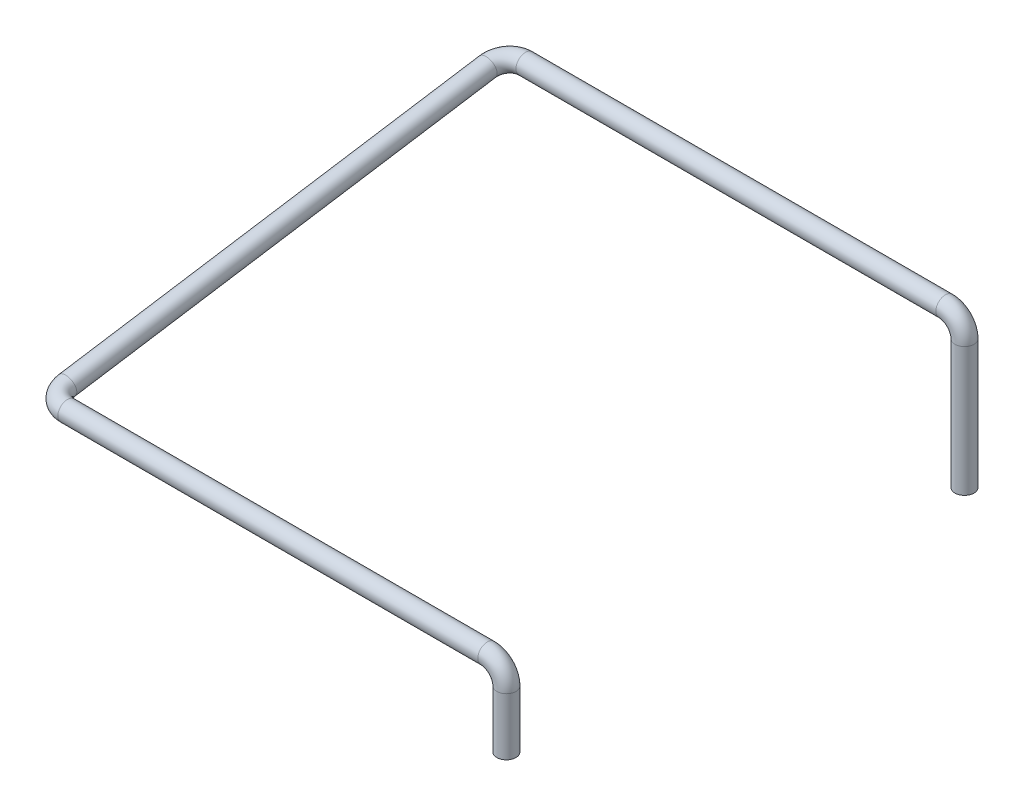
ISO-10303-21;
HEADER;
FILE_DESCRIPTION(('STEP AP214'),'2;1');
FILE_NAME('part.step','',(''),(''),'','','');
FILE_SCHEMA(('AUTOMOTIVE_DESIGN { 1 0 10303 214 1 1 1 1 }'));
ENDSEC;
DATA;
#1=APPLICATION_CONTEXT('core data for automotive mechanical design processes');
#2=APPLICATION_PROTOCOL_DEFINITION('international standard','automotive_design',2000,#1);
#3=PRODUCT_CONTEXT('',#1,'mechanical');
#4=PRODUCT('Part','Part','',(#3));
#5=PRODUCT_RELATED_PRODUCT_CATEGORY('part','',(#4));
#6=PRODUCT_DEFINITION_FORMATION('','',#4);
#7=PRODUCT_DEFINITION_CONTEXT('part definition',#1,'design');
#8=PRODUCT_DEFINITION('design','',#6,#7);
#9=PRODUCT_DEFINITION_SHAPE('','',#8);
#10=(LENGTH_UNIT() NAMED_UNIT(*) SI_UNIT(.MILLI.,.METRE.));
#11=(NAMED_UNIT(*) PLANE_ANGLE_UNIT() SI_UNIT($,.RADIAN.));
#12=(NAMED_UNIT(*) SI_UNIT($,.STERADIAN.) SOLID_ANGLE_UNIT());
#13=UNCERTAINTY_MEASURE_WITH_UNIT(LENGTH_MEASURE(1.E-05),#10,'distance_accuracy_value','');
#14=(GEOMETRIC_REPRESENTATION_CONTEXT(3) GLOBAL_UNCERTAINTY_ASSIGNED_CONTEXT((#13)) GLOBAL_UNIT_ASSIGNED_CONTEXT((#10,
#11,#12)) REPRESENTATION_CONTEXT('',''));
#15=CARTESIAN_POINT('',(0.,0.,0.));
#16=DIRECTION('',(0.,0.,1.));
#17=DIRECTION('',(1.,0.,0.));
#18=AXIS2_PLACEMENT_3D('',#15,#16,#17);
#19=CARTESIAN_POINT('',(23.,-1.,0.));
#20=DIRECTION('',(0.,-1.,0.));
#21=DIRECTION('',(0.,0.,-1.));
#22=AXIS2_PLACEMENT_3D('',#19,#20,#21);
#23=CYLINDRICAL_SURFACE('',#22,0.5);
#24=CARTESIAN_POINT('',(23.,-1.,0.));
#25=DIRECTION('',(0.,-1.,0.));
#26=DIRECTION('',(0.,0.,-1.));
#27=AXIS2_PLACEMENT_3D('',#24,#25,#26);
#28=CIRCLE('',#27,0.5);
#29=CARTESIAN_POINT('',(23.5,-1.,0.));
#30=VERTEX_POINT('',#29);
#31=EDGE_CURVE('E34',#30,#30,#28,.T.);
#32=ORIENTED_EDGE('',*,*,#31,.T.);
#33=EDGE_LOOP('',(#32));
#34=FACE_BOUND('',#33,.T.);
#35=CARTESIAN_POINT('',(23.,-4.,0.));
#36=DIRECTION('',(0.,-1.,0.));
#37=DIRECTION('',(0.,0.,-1.));
#38=AXIS2_PLACEMENT_3D('',#35,#36,#37);
#39=CIRCLE('',#38,0.5);
#40=CARTESIAN_POINT('',(23.,-4.,-0.5));
#41=VERTEX_POINT('',#40);
#42=EDGE_CURVE('E10',#41,#41,#39,.T.);
#43=ORIENTED_EDGE('',*,*,#42,.F.);
#44=EDGE_LOOP('',(#43));
#45=FACE_BOUND('',#44,.T.);
#46=ADVANCED_FACE('F28',(#34,#45),#23,.T.);
#47=CARTESIAN_POINT('',(22.,-1.,0.));
#48=DIRECTION('',(0.,0.,-1.));
#49=DIRECTION('',(-1.,0.,0.));
#50=AXIS2_PLACEMENT_3D('',#47,#48,#49);
#51=TOROIDAL_SURFACE('',#50,1.,0.5);
#52=CARTESIAN_POINT('',(22.,0.,0.));
#53=DIRECTION('',(1.,0.,0.));
#54=DIRECTION('',(0.,0.,-1.));
#55=AXIS2_PLACEMENT_3D('',#52,#53,#54);
#56=CIRCLE('',#55,0.5);
#57=CARTESIAN_POINT('',(22.,0.5,0.));
#58=VERTEX_POINT('',#57);
#59=EDGE_CURVE('E38',#58,#58,#56,.T.);
#60=CARTESIAN_POINT('',(22.,-1.,0.));
#61=DIRECTION('',(0.,0.,-1.));
#62=DIRECTION('',(-1.,0.,0.));
#63=AXIS2_PLACEMENT_3D('',#60,#61,#62);
#64=CIRCLE('',#63,1.5);
#65=EDGE_CURVE('',#58,#30,#64,.T.);
#66=ORIENTED_EDGE('',*,*,#59,.T.);
#67=ORIENTED_EDGE('',*,*,#31,.F.);
#68=ORIENTED_EDGE('',*,*,#65,.T.);
#69=ORIENTED_EDGE('',*,*,#65,.F.);
#70=EDGE_LOOP('',(#66,#68,#67,#69));
#71=FACE_BOUND('',#70,.T.);
#72=ADVANCED_FACE('F92',(#71),#51,.T.);
#73=CARTESIAN_POINT('',(22.,0.,0.));
#74=DIRECTION('',(-1.,0.,0.));
#75=DIRECTION('',(0.,0.,1.));
#76=AXIS2_PLACEMENT_3D('',#73,#74,#75);
#77=CYLINDRICAL_SURFACE('',#76,0.5);
#78=ORIENTED_EDGE('',*,*,#59,.F.);
#79=EDGE_LOOP('',(#78));
#80=FACE_BOUND('',#79,.T.);
#81=CARTESIAN_POINT('',(0.,0.,0.));
#82=DIRECTION('',(-1.,0.,0.));
#83=DIRECTION('',(0.,0.,1.));
#84=AXIS2_PLACEMENT_3D('',#81,#82,#83);
#85=CIRCLE('',#84,0.5);
#86=CARTESIAN_POINT('',(0.,-0.0771884401368047,0.494006016875551));
#87=VERTEX_POINT('',#86);
#88=EDGE_CURVE('E53',#87,#87,#85,.T.);
#89=ORIENTED_EDGE('',*,*,#88,.F.);
#90=EDGE_LOOP('',(#89));
#91=FACE_BOUND('',#90,.T.);
#92=ADVANCED_FACE('F89',(#80,#91),#77,.T.);
#93=CARTESIAN_POINT('',(23.,-4.,0.));
#94=DIRECTION('',(0.,-1.,0.));
#95=DIRECTION('',(0.,0.,-1.));
#96=AXIS2_PLACEMENT_3D('',#93,#94,#95);
#97=PLANE('',#96);
#98=ORIENTED_EDGE('',*,*,#42,.T.);
#99=EDGE_LOOP('',(#98));
#100=FACE_BOUND('',#99,.T.);
#101=ADVANCED_FACE('F79',(#100),#97,.T.);
#102=CARTESIAN_POINT('',(0.,3.59562311972639,-23.0119879662489));
#103=DIRECTION('',(0.,-0.988012033751101,-0.154376880273609));
#104=DIRECTION('',(0.,0.154376880273609,-0.988012033751101));
#105=AXIS2_PLACEMENT_3D('',#102,#103,#104);
#106=TOROIDAL_SURFACE('',#105,1.,0.5);
#107=CARTESIAN_POINT('',(-1.,3.59562311972639,-23.0119879662489));
#108=DIRECTION('',(0.,0.154376880273609,-0.988012033751101));
#109=DIRECTION('',(-0.988012033751101,0.152526215443279,0.0238322211630107));
#110=AXIS2_PLACEMENT_3D('',#107,#108,#109);
#111=CIRCLE('',#110,0.5);
#112=CARTESIAN_POINT('',(-1.5,3.59562311972639,-23.0119879662489));
#113=VERTEX_POINT('',#112);
#114=EDGE_CURVE('E47',#113,#113,#111,.T.);
#115=CARTESIAN_POINT('',(0.,3.75,-24.));
#116=DIRECTION('',(1.,0.,0.));
#117=DIRECTION('',(0.,0.305052430886558,-0.952335557673975));
#118=AXIS2_PLACEMENT_3D('',#115,#116,#117);
#119=CIRCLE('',#118,0.5);
#120=CARTESIAN_POINT('',(0.,3.82718844013681,-24.4940060168756));
#121=VERTEX_POINT('',#120);
#122=EDGE_CURVE('E42',#121,#121,#119,.T.);
#123=CARTESIAN_POINT('',(0.,3.59562311972639,-23.0119879662489));
#124=DIRECTION('',(0.,-0.988012033751101,-0.154376880273609));
#125=DIRECTION('',(0.,0.154376880273609,-0.988012033751101));
#126=AXIS2_PLACEMENT_3D('',#123,#124,#125);
#127=CIRCLE('',#126,1.5);
#128=EDGE_CURVE('',#113,#121,#127,.T.);
#129=ORIENTED_EDGE('',*,*,#114,.T.);
#130=ORIENTED_EDGE('',*,*,#122,.F.);
#131=ORIENTED_EDGE('',*,*,#128,.T.);
#132=ORIENTED_EDGE('',*,*,#128,.F.);
#133=EDGE_LOOP('',(#129,#131,#130,#132));
#134=FACE_BOUND('',#133,.T.);
#135=ADVANCED_FACE('F76',(#134),#106,.T.);
#136=CARTESIAN_POINT('',(-1.,0.15437688027361,-0.988012033751101));
#137=DIRECTION('',(0.,0.154376880273609,-0.988012033751101));
#138=DIRECTION('',(0.,0.988012033751102,0.15437688027361));
#139=AXIS2_PLACEMENT_3D('',#136,#137,#138);
#140=CYLINDRICAL_SURFACE('',#139,0.5);
#141=CARTESIAN_POINT('',(-1.,0.15437688027361,-0.988012033751101));
#142=DIRECTION('',(0.,0.154376880273609,-0.988012033751101));
#143=DIRECTION('',(-0.988012033751101,0.152526215443279,0.0238322211630107));
#144=AXIS2_PLACEMENT_3D('',#141,#142,#143);
#145=CIRCLE('',#144,0.5);
#146=CARTESIAN_POINT('',(-1.5,0.15437688027361,-0.988012033751101));
#147=VERTEX_POINT('',#146);
#148=EDGE_CURVE('E50',#147,#147,#145,.T.);
#149=ORIENTED_EDGE('',*,*,#148,.T.);
#150=EDGE_LOOP('',(#149));
#151=FACE_BOUND('',#150,.T.);
#152=ORIENTED_EDGE('',*,*,#114,.F.);
#153=EDGE_LOOP('',(#152));
#154=FACE_BOUND('',#153,.T.);
#155=ADVANCED_FACE('F78',(#151,#154),#140,.T.);
#156=CARTESIAN_POINT('',(0.,0.15437688027361,-0.988012033751101));
#157=DIRECTION('',(0.,0.988012033751101,0.154376880273609));
#158=DIRECTION('',(0.,-0.154376880273609,0.988012033751101));
#159=AXIS2_PLACEMENT_3D('',#156,#157,#158);
#160=TOROIDAL_SURFACE('',#159,1.,0.5);
#161=CARTESIAN_POINT('',(0.,0.15437688027361,-0.988012033751101));
#162=DIRECTION('',(0.,0.988012033751101,0.154376880273609));
#163=DIRECTION('',(0.,-0.154376880273609,0.988012033751101));
#164=AXIS2_PLACEMENT_3D('',#161,#162,#163);
#165=CIRCLE('',#164,1.5);
#166=EDGE_CURVE('',#147,#87,#165,.T.);
#167=ORIENTED_EDGE('',*,*,#148,.F.);
#168=ORIENTED_EDGE('',*,*,#88,.T.);
#169=ORIENTED_EDGE('',*,*,#166,.T.);
#170=ORIENTED_EDGE('',*,*,#166,.F.);
#171=EDGE_LOOP('',(#167,#169,#168,#170));
#172=FACE_BOUND('',#171,.T.);
#173=ADVANCED_FACE('F86',(#172),#160,.T.);
#174=CARTESIAN_POINT('',(23.,2.74999999999996,-24.));
#175=DIRECTION('',(0.,-1.,0.));
#176=DIRECTION('',(1.,0.,0.));
#177=AXIS2_PLACEMENT_3D('',#174,#175,#176);
#178=CYLINDRICAL_SURFACE('',#177,0.499999999999999);
#179=CARTESIAN_POINT('',(23.,2.74999999999996,-24.));
#180=DIRECTION('',(0.,-1.,0.));
#181=DIRECTION('',(0.,0.,-1.));
#182=AXIS2_PLACEMENT_3D('',#179,#180,#181);
#183=CIRCLE('',#182,0.499999999999999);
#184=CARTESIAN_POINT('',(23.5,2.74999999999994,-24.));
#185=VERTEX_POINT('',#184);
#186=EDGE_CURVE('E59',#185,#185,#183,.T.);
#187=ORIENTED_EDGE('',*,*,#186,.T.);
#188=EDGE_LOOP('',(#187));
#189=FACE_BOUND('',#188,.T.);
#190=CARTESIAN_POINT('',(23.,-4.00000000000004,-24.));
#191=DIRECTION('',(0.,-1.,0.));
#192=DIRECTION('',(0.,0.,-1.));
#193=AXIS2_PLACEMENT_3D('',#190,#191,#192);
#194=CIRCLE('',#193,0.499999999999999);
#195=CARTESIAN_POINT('',(23.,-4.00000000000004,-24.5));
#196=VERTEX_POINT('',#195);
#197=EDGE_CURVE('E56',#196,#196,#194,.T.);
#198=ORIENTED_EDGE('',*,*,#197,.F.);
#199=EDGE_LOOP('',(#198));
#200=FACE_BOUND('',#199,.T.);
#201=ADVANCED_FACE('F109',(#189,#200),#178,.T.);
#202=CARTESIAN_POINT('',(22.,2.75,-24.));
#203=DIRECTION('',(0.,0.,-1.));
#204=DIRECTION('',(-1.,0.,0.));
#205=AXIS2_PLACEMENT_3D('',#202,#203,#204);
#206=TOROIDAL_SURFACE('',#205,0.999999999999998,0.499999999999999);
#207=CARTESIAN_POINT('',(22.,3.75,-24.));
#208=DIRECTION('',(1.,0.,0.));
#209=DIRECTION('',(0.,0.,-1.));
#210=AXIS2_PLACEMENT_3D('',#207,#208,#209);
#211=CIRCLE('',#210,0.499999999999999);
#212=CARTESIAN_POINT('',(22.0000000000001,4.25,-24.));
#213=VERTEX_POINT('',#212);
#214=EDGE_CURVE('E62',#213,#213,#211,.T.);
#215=CARTESIAN_POINT('',(22.,2.75,-24.));
#216=DIRECTION('',(0.,0.,-1.));
#217=DIRECTION('',(-1.,0.,0.));
#218=AXIS2_PLACEMENT_3D('',#215,#216,#217);
#219=CIRCLE('',#218,1.5);
#220=EDGE_CURVE('',#213,#185,#219,.T.);
#221=ORIENTED_EDGE('',*,*,#214,.T.);
#222=ORIENTED_EDGE('',*,*,#186,.F.);
#223=ORIENTED_EDGE('',*,*,#220,.T.);
#224=ORIENTED_EDGE('',*,*,#220,.F.);
#225=EDGE_LOOP('',(#221,#223,#222,#224));
#226=FACE_BOUND('',#225,.T.);
#227=ADVANCED_FACE('F66',(#226),#206,.T.);
#228=CARTESIAN_POINT('',(22.,3.75,-24.));
#229=DIRECTION('',(-1.,0.,0.));
#230=DIRECTION('',(0.,-1.,0.));
#231=AXIS2_PLACEMENT_3D('',#228,#229,#230);
#232=CYLINDRICAL_SURFACE('',#231,0.499999999999999);
#233=ORIENTED_EDGE('',*,*,#214,.F.);
#234=EDGE_LOOP('',(#233));
#235=FACE_BOUND('',#234,.T.);
#236=ORIENTED_EDGE('',*,*,#122,.T.);
#237=EDGE_LOOP('',(#236));
#238=FACE_BOUND('',#237,.T.);
#239=ADVANCED_FACE('F69',(#235,#238),#232,.T.);
#240=CARTESIAN_POINT('',(23.,-4.00000000000004,-24.));
#241=DIRECTION('',(0.,-1.,0.));
#242=DIRECTION('',(0.,0.,-1.));
#243=AXIS2_PLACEMENT_3D('',#240,#241,#242);
#244=PLANE('',#243);
#245=ORIENTED_EDGE('',*,*,#197,.T.);
#246=EDGE_LOOP('',(#245));
#247=FACE_BOUND('',#246,.T.);
#248=ADVANCED_FACE('F72',(#247),#244,.T.);
#249=CLOSED_SHELL('',(#46,#72,#92,#101,#135,#155,#173,#201,#227,#239,#248));
#250=MANIFOLD_SOLID_BREP('B2',#249);
#251=ADVANCED_BREP_SHAPE_REPRESENTATION('',(#18,#250),#14);
#252=SHAPE_DEFINITION_REPRESENTATION(#9,#251);
ENDSEC;
END-ISO-10303-21;
